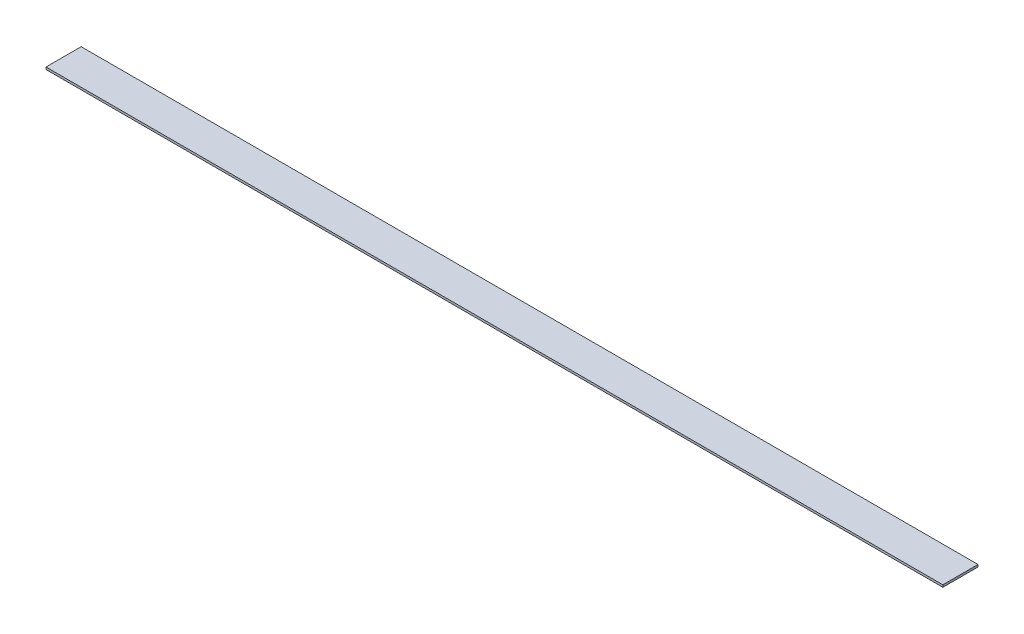
ISO-10303-21;
HEADER;
FILE_DESCRIPTION(('STEP AP214'),'2;1');
FILE_NAME('part.step','',(''),(''),'','','');
FILE_SCHEMA(('AUTOMOTIVE_DESIGN { 1 0 10303 214 1 1 1 1 }'));
ENDSEC;
DATA;
#1=APPLICATION_CONTEXT('core data for automotive mechanical design processes');
#2=APPLICATION_PROTOCOL_DEFINITION('international standard','automotive_design',2000,#1);
#3=PRODUCT_CONTEXT('',#1,'mechanical');
#4=PRODUCT('Part','Part','',(#3));
#5=PRODUCT_RELATED_PRODUCT_CATEGORY('part','',(#4));
#6=PRODUCT_DEFINITION_FORMATION('','',#4);
#7=PRODUCT_DEFINITION_CONTEXT('part definition',#1,'design');
#8=PRODUCT_DEFINITION('design','',#6,#7);
#9=PRODUCT_DEFINITION_SHAPE('','',#8);
#10=(LENGTH_UNIT() NAMED_UNIT(*) SI_UNIT(.MILLI.,.METRE.));
#11=(NAMED_UNIT(*) PLANE_ANGLE_UNIT() SI_UNIT($,.RADIAN.));
#12=(NAMED_UNIT(*) SI_UNIT($,.STERADIAN.) SOLID_ANGLE_UNIT());
#13=UNCERTAINTY_MEASURE_WITH_UNIT(LENGTH_MEASURE(1.E-05),#10,'distance_accuracy_value','');
#14=(GEOMETRIC_REPRESENTATION_CONTEXT(3) GLOBAL_UNCERTAINTY_ASSIGNED_CONTEXT((#13)) GLOBAL_UNIT_ASSIGNED_CONTEXT((#10,
#11,#12)) REPRESENTATION_CONTEXT('',''));
#15=CARTESIAN_POINT('',(0.,0.,0.));
#16=DIRECTION('',(0.,0.,1.));
#17=DIRECTION('',(1.,0.,0.));
#18=AXIS2_PLACEMENT_3D('',#15,#16,#17);
#19=CARTESIAN_POINT('',(1295.4,6.35,-50.8));
#20=DIRECTION('',(-1.,0.,0.));
#21=DIRECTION('',(0.,0.,1.));
#22=AXIS2_PLACEMENT_3D('',#19,#20,#21);
#23=PLANE('',#22);
#24=DIRECTION('',(0.,0.,-1.));
#25=VECTOR('',#24,1.);
#26=CARTESIAN_POINT('',(1295.4,0.,-50.8));
#27=LINE('',#26,#25);
#28=CARTESIAN_POINT('',(1295.4,0.,50.8));
#29=VERTEX_POINT('',#28);
#30=CARTESIAN_POINT('',(1295.4,0.,-50.8));
#31=VERTEX_POINT('',#30);
#32=EDGE_CURVE('E96',#29,#31,#27,.T.);
#33=ORIENTED_EDGE('',*,*,#32,.T.);
#34=DIRECTION('',(0.,-1.,0.));
#35=VECTOR('',#34,1.);
#36=CARTESIAN_POINT('',(1295.4,6.35,-50.8));
#37=LINE('',#36,#35);
#38=CARTESIAN_POINT('',(1295.4,6.35,-50.8));
#39=VERTEX_POINT('',#38);
#40=EDGE_CURVE('E11',#39,#31,#37,.T.);
#41=ORIENTED_EDGE('',*,*,#40,.F.);
#42=DIRECTION('',(0.,0.,-1.));
#43=VECTOR('',#42,1.);
#44=CARTESIAN_POINT('',(1295.4,6.35,-50.8));
#45=LINE('',#44,#43);
#46=CARTESIAN_POINT('',(1295.4,6.35,50.8));
#47=VERTEX_POINT('',#46);
#48=EDGE_CURVE('E84',#47,#39,#45,.T.);
#49=ORIENTED_EDGE('',*,*,#48,.F.);
#50=DIRECTION('',(0.,-1.,0.));
#51=VECTOR('',#50,1.);
#52=CARTESIAN_POINT('',(1295.4,6.35,50.8));
#53=LINE('',#52,#51);
#54=EDGE_CURVE('E92',#47,#29,#53,.T.);
#55=ORIENTED_EDGE('',*,*,#54,.T.);
#56=EDGE_LOOP('',(#33,#41,#49,#55));
#57=FACE_BOUND('',#56,.T.);
#58=ADVANCED_FACE('F33',(#57),#23,.F.);
#59=CARTESIAN_POINT('',(-1295.4,6.35,-50.8));
#60=DIRECTION('',(0.,0.,1.));
#61=DIRECTION('',(1.,0.,0.));
#62=AXIS2_PLACEMENT_3D('',#59,#60,#61);
#63=PLANE('',#62);
#64=DIRECTION('',(-1.,0.,0.));
#65=VECTOR('',#64,1.);
#66=CARTESIAN_POINT('',(-1295.4,0.,-50.8));
#67=LINE('',#66,#65);
#68=CARTESIAN_POINT('',(-1295.4,0.,-50.8));
#69=VERTEX_POINT('',#68);
#70=EDGE_CURVE('E88',#31,#69,#67,.T.);
#71=ORIENTED_EDGE('',*,*,#70,.T.);
#72=DIRECTION('',(0.,-1.,0.));
#73=VECTOR('',#72,1.);
#74=CARTESIAN_POINT('',(-1295.4,6.35,-50.8));
#75=LINE('',#74,#73);
#76=CARTESIAN_POINT('',(-1295.4,6.35,-50.8));
#77=VERTEX_POINT('',#76);
#78=EDGE_CURVE('E41',#77,#69,#75,.T.);
#79=ORIENTED_EDGE('',*,*,#78,.F.);
#80=DIRECTION('',(-1.,0.,0.));
#81=VECTOR('',#80,1.);
#82=CARTESIAN_POINT('',(-1295.4,6.35,-50.8));
#83=LINE('',#82,#81);
#84=EDGE_CURVE('E79',#39,#77,#83,.T.);
#85=ORIENTED_EDGE('',*,*,#84,.F.);
#86=ORIENTED_EDGE('',*,*,#40,.T.);
#87=EDGE_LOOP('',(#71,#79,#85,#86));
#88=FACE_BOUND('',#87,.T.);
#89=ADVANCED_FACE('F87',(#88),#63,.F.);
#90=CARTESIAN_POINT('',(-1295.4,6.35,-50.8));
#91=DIRECTION('',(1.,0.,0.));
#92=DIRECTION('',(0.,0.,-1.));
#93=AXIS2_PLACEMENT_3D('',#90,#91,#92);
#94=PLANE('',#93);
#95=DIRECTION('',(0.,0.,1.));
#96=VECTOR('',#95,1.);
#97=CARTESIAN_POINT('',(-1295.4,0.,-50.8));
#98=LINE('',#97,#96);
#99=CARTESIAN_POINT('',(-1295.4,0.,50.8));
#100=VERTEX_POINT('',#99);
#101=EDGE_CURVE('E66',#69,#100,#98,.T.);
#102=ORIENTED_EDGE('',*,*,#101,.T.);
#103=DIRECTION('',(0.,-1.,0.));
#104=VECTOR('',#103,1.);
#105=CARTESIAN_POINT('',(-1295.4,6.35,50.8));
#106=LINE('',#105,#104);
#107=CARTESIAN_POINT('',(-1295.4,6.35,50.8));
#108=VERTEX_POINT('',#107);
#109=EDGE_CURVE('E89',#108,#100,#106,.T.);
#110=ORIENTED_EDGE('',*,*,#109,.F.);
#111=DIRECTION('',(0.,0.,1.));
#112=VECTOR('',#111,1.);
#113=CARTESIAN_POINT('',(-1295.4,6.35,-50.8));
#114=LINE('',#113,#112);
#115=EDGE_CURVE('E82',#77,#108,#114,.T.);
#116=ORIENTED_EDGE('',*,*,#115,.F.);
#117=ORIENTED_EDGE('',*,*,#78,.T.);
#118=EDGE_LOOP('',(#102,#110,#116,#117));
#119=FACE_BOUND('',#118,.T.);
#120=ADVANCED_FACE('F90',(#119),#94,.F.);
#121=CARTESIAN_POINT('',(-1295.4,6.35,50.8));
#122=DIRECTION('',(0.,0.,-1.));
#123=DIRECTION('',(-1.,0.,0.));
#124=AXIS2_PLACEMENT_3D('',#121,#122,#123);
#125=PLANE('',#124);
#126=DIRECTION('',(1.,0.,0.));
#127=VECTOR('',#126,1.);
#128=CARTESIAN_POINT('',(-1295.4,0.,50.8));
#129=LINE('',#128,#127);
#130=EDGE_CURVE('E72',#100,#29,#129,.T.);
#131=ORIENTED_EDGE('',*,*,#130,.T.);
#132=ORIENTED_EDGE('',*,*,#54,.F.);
#133=DIRECTION('',(1.,0.,0.));
#134=VECTOR('',#133,1.);
#135=CARTESIAN_POINT('',(-1295.4,6.35,50.8));
#136=LINE('',#135,#134);
#137=EDGE_CURVE('E49',#108,#47,#136,.T.);
#138=ORIENTED_EDGE('',*,*,#137,.F.);
#139=ORIENTED_EDGE('',*,*,#109,.T.);
#140=EDGE_LOOP('',(#131,#132,#138,#139));
#141=FACE_BOUND('',#140,.T.);
#142=ADVANCED_FACE('F103',(#141),#125,.F.);
#143=CARTESIAN_POINT('',(0.,6.35,0.));
#144=DIRECTION('',(0.,1.,0.));
#145=DIRECTION('',(0.,0.,1.));
#146=AXIS2_PLACEMENT_3D('',#143,#144,#145);
#147=PLANE('',#146);
#148=ORIENTED_EDGE('',*,*,#48,.T.);
#149=ORIENTED_EDGE('',*,*,#84,.T.);
#150=ORIENTED_EDGE('',*,*,#115,.T.);
#151=ORIENTED_EDGE('',*,*,#137,.T.);
#152=EDGE_LOOP('',(#148,#149,#150,#151));
#153=FACE_BOUND('',#152,.T.);
#154=ADVANCED_FACE('F80',(#153),#147,.T.);
#155=CARTESIAN_POINT('',(0.,0.,0.));
#156=DIRECTION('',(0.,1.,0.));
#157=DIRECTION('',(0.,0.,1.));
#158=AXIS2_PLACEMENT_3D('',#155,#156,#157);
#159=PLANE('',#158);
#160=ORIENTED_EDGE('',*,*,#32,.F.);
#161=ORIENTED_EDGE('',*,*,#130,.F.);
#162=ORIENTED_EDGE('',*,*,#101,.F.);
#163=ORIENTED_EDGE('',*,*,#70,.F.);
#164=EDGE_LOOP('',(#160,#161,#162,#163));
#165=FACE_BOUND('',#164,.T.);
#166=ADVANCED_FACE('F106',(#165),#159,.F.);
#167=CLOSED_SHELL('',(#58,#89,#120,#142,#154,#166));
#168=MANIFOLD_SOLID_BREP('B2',#167);
#169=ADVANCED_BREP_SHAPE_REPRESENTATION('',(#18,#168),#14);
#170=SHAPE_DEFINITION_REPRESENTATION(#9,#169);
ENDSEC;
END-ISO-10303-21;
